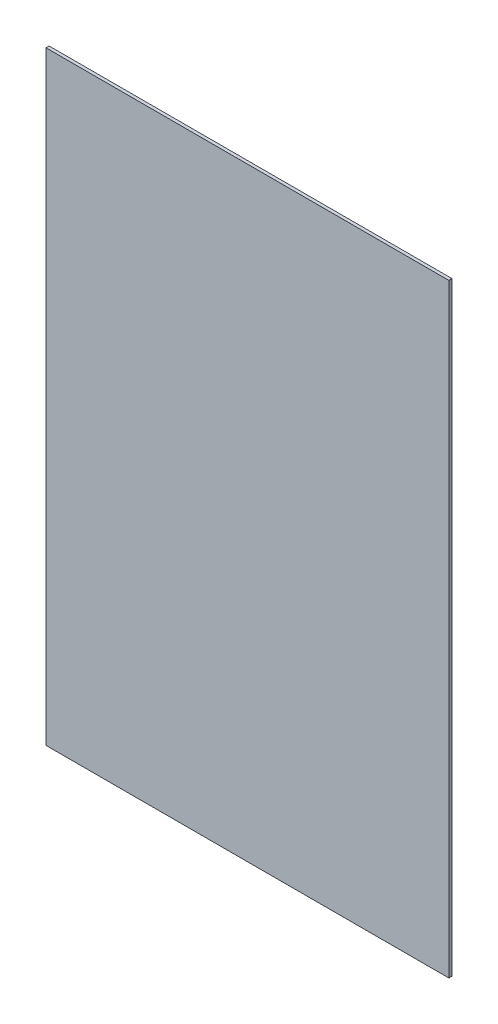
ISO-10303-21;
HEADER;
FILE_DESCRIPTION(('STEP AP214'),'2;1');
FILE_NAME('part.step','',(''),(''),'','','');
FILE_SCHEMA(('AUTOMOTIVE_DESIGN { 1 0 10303 214 1 1 1 1 }'));
ENDSEC;
DATA;
#1=APPLICATION_CONTEXT('core data for automotive mechanical design processes');
#2=APPLICATION_PROTOCOL_DEFINITION('international standard','automotive_design',2000,#1);
#3=PRODUCT_CONTEXT('',#1,'mechanical');
#4=PRODUCT('Part','Part','',(#3));
#5=PRODUCT_RELATED_PRODUCT_CATEGORY('part','',(#4));
#6=PRODUCT_DEFINITION_FORMATION('','',#4);
#7=PRODUCT_DEFINITION_CONTEXT('part definition',#1,'design');
#8=PRODUCT_DEFINITION('design','',#6,#7);
#9=PRODUCT_DEFINITION_SHAPE('','',#8);
#10=(LENGTH_UNIT() NAMED_UNIT(*) SI_UNIT(.MILLI.,.METRE.));
#11=(NAMED_UNIT(*) PLANE_ANGLE_UNIT() SI_UNIT($,.RADIAN.));
#12=(NAMED_UNIT(*) SI_UNIT($,.STERADIAN.) SOLID_ANGLE_UNIT());
#13=UNCERTAINTY_MEASURE_WITH_UNIT(LENGTH_MEASURE(1.E-05),#10,'distance_accuracy_value','');
#14=(GEOMETRIC_REPRESENTATION_CONTEXT(3) GLOBAL_UNCERTAINTY_ASSIGNED_CONTEXT((#13)) GLOBAL_UNIT_ASSIGNED_CONTEXT((#10,
#11,#12)) REPRESENTATION_CONTEXT('',''));
#15=CARTESIAN_POINT('',(0.,0.,0.));
#16=DIRECTION('',(0.,0.,1.));
#17=DIRECTION('',(1.,0.,0.));
#18=AXIS2_PLACEMENT_3D('',#15,#16,#17);
#19=CARTESIAN_POINT('',(0.,0.,4.7625));
#20=DIRECTION('',(1.,0.,0.));
#21=DIRECTION('',(0.,0.,-1.));
#22=AXIS2_PLACEMENT_3D('',#19,#20,#21);
#23=PLANE('',#22);
#24=DIRECTION('',(0.,-1.,0.));
#25=VECTOR('',#24,1.);
#26=CARTESIAN_POINT('',(0.,0.,0.));
#27=LINE('',#26,#25);
#28=CARTESIAN_POINT('',(0.,914.4,0.));
#29=VERTEX_POINT('',#28);
#30=CARTESIAN_POINT('',(0.,0.,0.));
#31=VERTEX_POINT('',#30);
#32=EDGE_CURVE('E98',#29,#31,#27,.T.);
#33=ORIENTED_EDGE('',*,*,#32,.T.);
#34=DIRECTION('',(0.,0.,-1.));
#35=VECTOR('',#34,1.);
#36=CARTESIAN_POINT('',(0.,0.,4.7625));
#37=LINE('',#36,#35);
#38=CARTESIAN_POINT('',(0.,0.,4.7625));
#39=VERTEX_POINT('',#38);
#40=EDGE_CURVE('E11',#39,#31,#37,.T.);
#41=ORIENTED_EDGE('',*,*,#40,.F.);
#42=DIRECTION('',(0.,-1.,0.));
#43=VECTOR('',#42,1.);
#44=CARTESIAN_POINT('',(0.,0.,4.7625));
#45=LINE('',#44,#43);
#46=CARTESIAN_POINT('',(0.,914.4,4.7625));
#47=VERTEX_POINT('',#46);
#48=EDGE_CURVE('E86',#47,#39,#45,.T.);
#49=ORIENTED_EDGE('',*,*,#48,.F.);
#50=DIRECTION('',(0.,0.,-1.));
#51=VECTOR('',#50,1.);
#52=CARTESIAN_POINT('',(0.,914.4,4.7625));
#53=LINE('',#52,#51);
#54=EDGE_CURVE('E94',#47,#29,#53,.T.);
#55=ORIENTED_EDGE('',*,*,#54,.T.);
#56=EDGE_LOOP('',(#33,#41,#49,#55));
#57=FACE_BOUND('',#56,.T.);
#58=ADVANCED_FACE('F35',(#57),#23,.F.);
#59=CARTESIAN_POINT('',(0.,0.,4.7625));
#60=DIRECTION('',(0.,1.,0.));
#61=DIRECTION('',(0.,0.,1.));
#62=AXIS2_PLACEMENT_3D('',#59,#60,#61);
#63=PLANE('',#62);
#64=DIRECTION('',(1.,0.,0.));
#65=VECTOR('',#64,1.);
#66=CARTESIAN_POINT('',(0.,0.,0.));
#67=LINE('',#66,#65);
#68=CARTESIAN_POINT('',(609.6,0.,0.));
#69=VERTEX_POINT('',#68);
#70=EDGE_CURVE('E90',#31,#69,#67,.T.);
#71=ORIENTED_EDGE('',*,*,#70,.T.);
#72=DIRECTION('',(0.,0.,-1.));
#73=VECTOR('',#72,1.);
#74=CARTESIAN_POINT('',(609.6,0.,4.7625));
#75=LINE('',#74,#73);
#76=CARTESIAN_POINT('',(609.6,0.,4.7625));
#77=VERTEX_POINT('',#76);
#78=EDGE_CURVE('E43',#77,#69,#75,.T.);
#79=ORIENTED_EDGE('',*,*,#78,.F.);
#80=DIRECTION('',(1.,0.,0.));
#81=VECTOR('',#80,1.);
#82=CARTESIAN_POINT('',(0.,0.,4.7625));
#83=LINE('',#82,#81);
#84=EDGE_CURVE('E81',#39,#77,#83,.T.);
#85=ORIENTED_EDGE('',*,*,#84,.F.);
#86=ORIENTED_EDGE('',*,*,#40,.T.);
#87=EDGE_LOOP('',(#71,#79,#85,#86));
#88=FACE_BOUND('',#87,.T.);
#89=ADVANCED_FACE('F89',(#88),#63,.F.);
#90=CARTESIAN_POINT('',(609.6,0.,4.7625));
#91=DIRECTION('',(-1.,0.,0.));
#92=DIRECTION('',(0.,0.,1.));
#93=AXIS2_PLACEMENT_3D('',#90,#91,#92);
#94=PLANE('',#93);
#95=DIRECTION('',(0.,1.,0.));
#96=VECTOR('',#95,1.);
#97=CARTESIAN_POINT('',(609.6,0.,0.));
#98=LINE('',#97,#96);
#99=CARTESIAN_POINT('',(609.6,914.4,0.));
#100=VERTEX_POINT('',#99);
#101=EDGE_CURVE('E68',#69,#100,#98,.T.);
#102=ORIENTED_EDGE('',*,*,#101,.T.);
#103=DIRECTION('',(0.,0.,-1.));
#104=VECTOR('',#103,1.);
#105=CARTESIAN_POINT('',(609.6,914.4,4.7625));
#106=LINE('',#105,#104);
#107=CARTESIAN_POINT('',(609.6,914.4,4.7625));
#108=VERTEX_POINT('',#107);
#109=EDGE_CURVE('E91',#108,#100,#106,.T.);
#110=ORIENTED_EDGE('',*,*,#109,.F.);
#111=DIRECTION('',(0.,1.,0.));
#112=VECTOR('',#111,1.);
#113=CARTESIAN_POINT('',(609.6,0.,4.7625));
#114=LINE('',#113,#112);
#115=EDGE_CURVE('E84',#77,#108,#114,.T.);
#116=ORIENTED_EDGE('',*,*,#115,.F.);
#117=ORIENTED_EDGE('',*,*,#78,.T.);
#118=EDGE_LOOP('',(#102,#110,#116,#117));
#119=FACE_BOUND('',#118,.T.);
#120=ADVANCED_FACE('F92',(#119),#94,.F.);
#121=CARTESIAN_POINT('',(0.,914.4,4.7625));
#122=DIRECTION('',(0.,-1.,0.));
#123=DIRECTION('',(0.,0.,-1.));
#124=AXIS2_PLACEMENT_3D('',#121,#122,#123);
#125=PLANE('',#124);
#126=DIRECTION('',(-1.,0.,0.));
#127=VECTOR('',#126,1.);
#128=CARTESIAN_POINT('',(0.,914.4,0.));
#129=LINE('',#128,#127);
#130=EDGE_CURVE('E74',#100,#29,#129,.T.);
#131=ORIENTED_EDGE('',*,*,#130,.T.);
#132=ORIENTED_EDGE('',*,*,#54,.F.);
#133=DIRECTION('',(-1.,0.,0.));
#134=VECTOR('',#133,1.);
#135=CARTESIAN_POINT('',(0.,914.4,4.7625));
#136=LINE('',#135,#134);
#137=EDGE_CURVE('E51',#108,#47,#136,.T.);
#138=ORIENTED_EDGE('',*,*,#137,.F.);
#139=ORIENTED_EDGE('',*,*,#109,.T.);
#140=EDGE_LOOP('',(#131,#132,#138,#139));
#141=FACE_BOUND('',#140,.T.);
#142=ADVANCED_FACE('F105',(#141),#125,.F.);
#143=CARTESIAN_POINT('',(0.,914.4,4.7625));
#144=DIRECTION('',(0.,0.,-1.));
#145=DIRECTION('',(-1.,0.,0.));
#146=AXIS2_PLACEMENT_3D('',#143,#144,#145);
#147=PLANE('',#146);
#148=ORIENTED_EDGE('',*,*,#48,.T.);
#149=ORIENTED_EDGE('',*,*,#84,.T.);
#150=ORIENTED_EDGE('',*,*,#115,.T.);
#151=ORIENTED_EDGE('',*,*,#137,.T.);
#152=EDGE_LOOP('',(#148,#149,#150,#151));
#153=FACE_BOUND('',#152,.T.);
#154=ADVANCED_FACE('F82',(#153),#147,.F.);
#155=CARTESIAN_POINT('',(0.,914.4,0.));
#156=DIRECTION('',(0.,0.,-1.));
#157=DIRECTION('',(-1.,0.,0.));
#158=AXIS2_PLACEMENT_3D('',#155,#156,#157);
#159=PLANE('',#158);
#160=ORIENTED_EDGE('',*,*,#32,.F.);
#161=ORIENTED_EDGE('',*,*,#130,.F.);
#162=ORIENTED_EDGE('',*,*,#101,.F.);
#163=ORIENTED_EDGE('',*,*,#70,.F.);
#164=EDGE_LOOP('',(#160,#161,#162,#163));
#165=FACE_BOUND('',#164,.T.);
#166=ADVANCED_FACE('F108',(#165),#159,.T.);
#167=CLOSED_SHELL('',(#58,#89,#120,#142,#154,#166));
#168=MANIFOLD_SOLID_BREP('B2',#167);
#169=ADVANCED_BREP_SHAPE_REPRESENTATION('',(#18,#168),#14);
#170=SHAPE_DEFINITION_REPRESENTATION(#9,#169);
ENDSEC;
END-ISO-10303-21;
